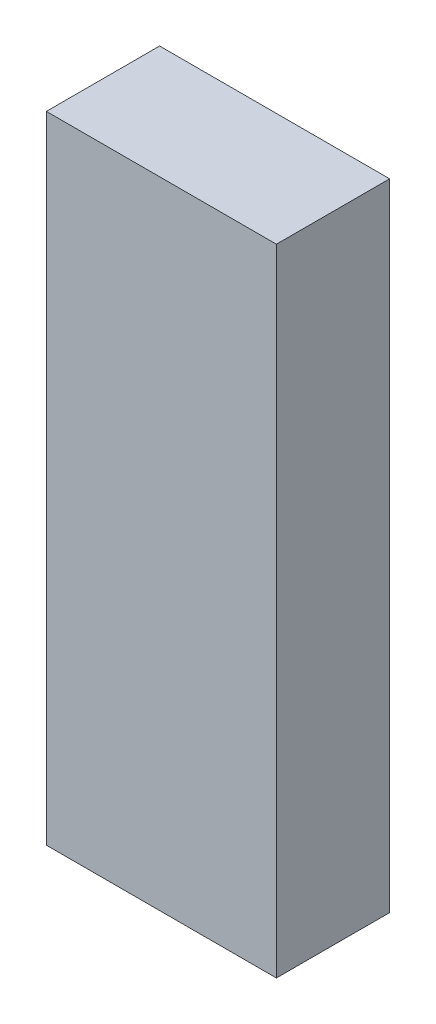
ISO-10303-21;
HEADER;
FILE_DESCRIPTION(('STEP AP214'),'2;1');
FILE_NAME('part.step','',(''),(''),'','','');
FILE_SCHEMA(('AUTOMOTIVE_DESIGN { 1 0 10303 214 1 1 1 1 }'));
ENDSEC;
DATA;
#1=APPLICATION_CONTEXT('core data for automotive mechanical design processes');
#2=APPLICATION_PROTOCOL_DEFINITION('international standard','automotive_design',2000,#1);
#3=PRODUCT_CONTEXT('',#1,'mechanical');
#4=PRODUCT('Part','Part','',(#3));
#5=PRODUCT_RELATED_PRODUCT_CATEGORY('part','',(#4));
#6=PRODUCT_DEFINITION_FORMATION('','',#4);
#7=PRODUCT_DEFINITION_CONTEXT('part definition',#1,'design');
#8=PRODUCT_DEFINITION('design','',#6,#7);
#9=PRODUCT_DEFINITION_SHAPE('','',#8);
#10=(LENGTH_UNIT() NAMED_UNIT(*) SI_UNIT(.MILLI.,.METRE.));
#11=(NAMED_UNIT(*) PLANE_ANGLE_UNIT() SI_UNIT($,.RADIAN.));
#12=(NAMED_UNIT(*) SI_UNIT($,.STERADIAN.) SOLID_ANGLE_UNIT());
#13=UNCERTAINTY_MEASURE_WITH_UNIT(LENGTH_MEASURE(1.E-05),#10,'distance_accuracy_value','');
#14=(GEOMETRIC_REPRESENTATION_CONTEXT(3) GLOBAL_UNCERTAINTY_ASSIGNED_CONTEXT((#13)) GLOBAL_UNIT_ASSIGNED_CONTEXT((#10,
#11,#12)) REPRESENTATION_CONTEXT('',''));
#15=CARTESIAN_POINT('',(0.,0.,0.));
#16=DIRECTION('',(0.,0.,1.));
#17=DIRECTION('',(1.,0.,0.));
#18=AXIS2_PLACEMENT_3D('',#15,#16,#17);
#19=CARTESIAN_POINT('',(-0.32500316,0.45719492,0.31999936));
#20=DIRECTION('',(0.,0.,-1.));
#21=DIRECTION('',(-1.,0.,0.));
#22=AXIS2_PLACEMENT_3D('',#19,#20,#21);
#23=PLANE('',#22);
#24=DIRECTION('',(0.,1.,0.));
#25=VECTOR('',#24,1.);
#26=CARTESIAN_POINT('',(0.32499808,-1.3386308,0.31999936));
#27=LINE('',#26,#25);
#28=CARTESIAN_POINT('',(0.32499808,-1.3386308,0.31999936));
#29=VERTEX_POINT('',#28);
#30=CARTESIAN_POINT('',(0.32499808,0.45719492,0.31999936));
#31=VERTEX_POINT('',#30);
#32=EDGE_CURVE('E80',#29,#31,#27,.T.);
#33=ORIENTED_EDGE('',*,*,#32,.T.);
#34=DIRECTION('',(1.,0.,0.));
#35=VECTOR('',#34,1.);
#36=CARTESIAN_POINT('',(0.32499808,0.45719492,0.31999936));
#37=LINE('',#36,#35);
#38=CARTESIAN_POINT('',(-0.32500316,0.45719492,0.31999936));
#39=VERTEX_POINT('',#38);
#40=EDGE_CURVE('E55',#31,#39,#37,.F.);
#41=ORIENTED_EDGE('',*,*,#40,.T.);
#42=DIRECTION('',(0.,1.,0.));
#43=VECTOR('',#42,1.);
#44=CARTESIAN_POINT('',(-0.32500316,0.45719492,0.31999936));
#45=LINE('',#44,#43);
#46=CARTESIAN_POINT('',(-0.32500316,-1.3386308,0.31999936));
#47=VERTEX_POINT('',#46);
#48=EDGE_CURVE('E57',#39,#47,#45,.F.);
#49=ORIENTED_EDGE('',*,*,#48,.T.);
#50=DIRECTION('',(1.,0.,0.));
#51=VECTOR('',#50,1.);
#52=CARTESIAN_POINT('',(-0.32500316,-1.3386308,0.31999936));
#53=LINE('',#52,#51);
#54=EDGE_CURVE('E20',#47,#29,#53,.T.);
#55=ORIENTED_EDGE('',*,*,#54,.T.);
#56=EDGE_LOOP('',(#33,#41,#49,#55));
#57=FACE_BOUND('',#56,.T.);
#58=ADVANCED_FACE('F17',(#57),#23,.F.);
#59=CARTESIAN_POINT('',(-0.32500316,-1.3386308,0.));
#60=DIRECTION('',(0.,1.,0.));
#61=DIRECTION('',(0.,0.,1.));
#62=AXIS2_PLACEMENT_3D('',#59,#60,#61);
#63=PLANE('',#62);
#64=ORIENTED_EDGE('',*,*,#54,.F.);
#65=DIRECTION('',(0.,0.,-1.));
#66=VECTOR('',#65,1.);
#67=CARTESIAN_POINT('',(-0.32500316,-1.3386308,0.));
#68=LINE('',#67,#66);
#69=CARTESIAN_POINT('',(-0.32500316,-1.3386308,0.));
#70=VERTEX_POINT('',#69);
#71=EDGE_CURVE('E63',#47,#70,#68,.T.);
#72=ORIENTED_EDGE('',*,*,#71,.T.);
#73=DIRECTION('',(-1.,0.,0.));
#74=VECTOR('',#73,1.);
#75=CARTESIAN_POINT('',(-0.32500316,-1.3386308,0.));
#76=LINE('',#75,#74);
#77=CARTESIAN_POINT('',(0.32499808,-1.3386308,0.));
#78=VERTEX_POINT('',#77);
#79=EDGE_CURVE('E83',#78,#70,#76,.T.);
#80=ORIENTED_EDGE('',*,*,#79,.F.);
#81=DIRECTION('',(0.,0.,1.));
#82=VECTOR('',#81,1.);
#83=CARTESIAN_POINT('',(0.32499808,-1.3386308,0.));
#84=LINE('',#83,#82);
#85=EDGE_CURVE('E68',#78,#29,#84,.T.);
#86=ORIENTED_EDGE('',*,*,#85,.T.);
#87=EDGE_LOOP('',(#64,#72,#80,#86));
#88=FACE_BOUND('',#87,.T.);
#89=ADVANCED_FACE('F65',(#88),#63,.F.);
#90=CARTESIAN_POINT('',(-0.32500316,0.45719492,0.));
#91=DIRECTION('',(1.,0.,0.));
#92=DIRECTION('',(0.,0.,-1.));
#93=AXIS2_PLACEMENT_3D('',#90,#91,#92);
#94=PLANE('',#93);
#95=ORIENTED_EDGE('',*,*,#48,.F.);
#96=DIRECTION('',(0.,0.,-1.));
#97=VECTOR('',#96,1.);
#98=CARTESIAN_POINT('',(-0.32500316,0.45719492,0.));
#99=LINE('',#98,#97);
#100=CARTESIAN_POINT('',(-0.32500316,0.45719492,0.));
#101=VERTEX_POINT('',#100);
#102=EDGE_CURVE('E75',#39,#101,#99,.T.);
#103=ORIENTED_EDGE('',*,*,#102,.T.);
#104=DIRECTION('',(0.,1.,0.));
#105=VECTOR('',#104,1.);
#106=CARTESIAN_POINT('',(-0.32500316,0.45719492,0.));
#107=LINE('',#106,#105);
#108=EDGE_CURVE('E72',#70,#101,#107,.T.);
#109=ORIENTED_EDGE('',*,*,#108,.F.);
#110=ORIENTED_EDGE('',*,*,#71,.F.);
#111=EDGE_LOOP('',(#95,#103,#109,#110));
#112=FACE_BOUND('',#111,.T.);
#113=ADVANCED_FACE('F70',(#112),#94,.F.);
#114=CARTESIAN_POINT('',(0.32499808,0.45719492,0.));
#115=DIRECTION('',(0.,-1.,0.));
#116=DIRECTION('',(0.,0.,-1.));
#117=AXIS2_PLACEMENT_3D('',#114,#115,#116);
#118=PLANE('',#117);
#119=ORIENTED_EDGE('',*,*,#40,.F.);
#120=DIRECTION('',(0.,0.,1.));
#121=VECTOR('',#120,1.);
#122=CARTESIAN_POINT('',(0.32499808,0.45719492,0.));
#123=LINE('',#122,#121);
#124=CARTESIAN_POINT('',(0.32499808,0.45719492,0.));
#125=VERTEX_POINT('',#124);
#126=EDGE_CURVE('E35',#31,#125,#123,.F.);
#127=ORIENTED_EDGE('',*,*,#126,.T.);
#128=DIRECTION('',(-1.,0.,0.));
#129=VECTOR('',#128,1.);
#130=CARTESIAN_POINT('',(-0.32500316,0.45719492,0.));
#131=LINE('',#130,#129);
#132=EDGE_CURVE('E26',#101,#125,#131,.F.);
#133=ORIENTED_EDGE('',*,*,#132,.F.);
#134=ORIENTED_EDGE('',*,*,#102,.F.);
#135=EDGE_LOOP('',(#119,#127,#133,#134));
#136=FACE_BOUND('',#135,.T.);
#137=ADVANCED_FACE('F89',(#136),#118,.F.);
#138=CARTESIAN_POINT('',(0.32499808,-1.3386308,0.));
#139=DIRECTION('',(-1.,0.,0.));
#140=DIRECTION('',(0.,0.,1.));
#141=AXIS2_PLACEMENT_3D('',#138,#139,#140);
#142=PLANE('',#141);
#143=ORIENTED_EDGE('',*,*,#32,.F.);
#144=ORIENTED_EDGE('',*,*,#85,.F.);
#145=DIRECTION('',(0.,1.,0.));
#146=VECTOR('',#145,1.);
#147=CARTESIAN_POINT('',(0.32499808,0.45719492,0.));
#148=LINE('',#147,#146);
#149=EDGE_CURVE('E11',#125,#78,#148,.F.);
#150=ORIENTED_EDGE('',*,*,#149,.F.);
#151=ORIENTED_EDGE('',*,*,#126,.F.);
#152=EDGE_LOOP('',(#143,#144,#150,#151));
#153=FACE_BOUND('',#152,.T.);
#154=ADVANCED_FACE('F91',(#153),#142,.F.);
#155=CARTESIAN_POINT('',(-0.32500316,0.45719492,0.));
#156=DIRECTION('',(0.,0.,-1.));
#157=DIRECTION('',(-1.,0.,0.));
#158=AXIS2_PLACEMENT_3D('',#155,#156,#157);
#159=PLANE('',#158);
#160=ORIENTED_EDGE('',*,*,#132,.T.);
#161=ORIENTED_EDGE('',*,*,#149,.T.);
#162=ORIENTED_EDGE('',*,*,#79,.T.);
#163=ORIENTED_EDGE('',*,*,#108,.T.);
#164=EDGE_LOOP('',(#160,#161,#162,#163));
#165=FACE_BOUND('',#164,.T.);
#166=ADVANCED_FACE('F88',(#165),#159,.T.);
#167=CLOSED_SHELL('',(#58,#89,#113,#137,#154,#166));
#168=MANIFOLD_SOLID_BREP('B1',#167);
#169=ADVANCED_BREP_SHAPE_REPRESENTATION('',(#18,#168),#14);
#170=SHAPE_DEFINITION_REPRESENTATION(#9,#169);
ENDSEC;
END-ISO-10303-21;
